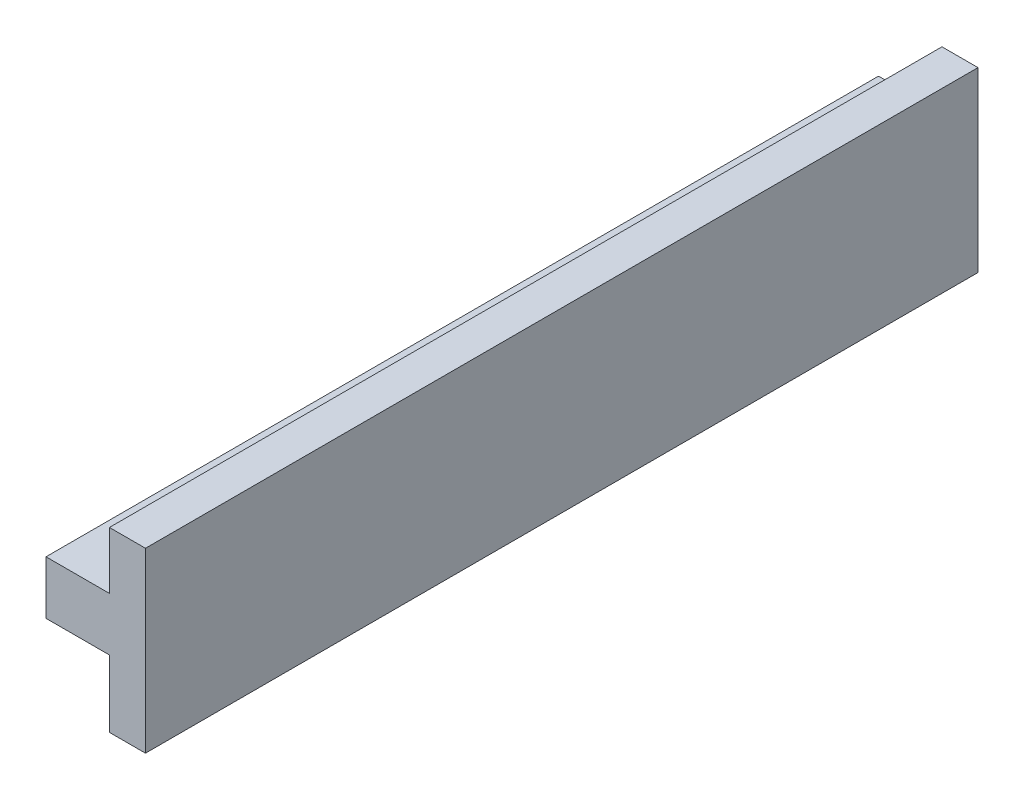
ISO-10303-21;
HEADER;
FILE_DESCRIPTION(('STEP AP214'),'2;1');
FILE_NAME('part.step','',(''),(''),'','','');
FILE_SCHEMA(('AUTOMOTIVE_DESIGN { 1 0 10303 214 1 1 1 1 }'));
ENDSEC;
DATA;
#1=APPLICATION_CONTEXT('core data for automotive mechanical design processes');
#2=APPLICATION_PROTOCOL_DEFINITION('international standard','automotive_design',2000,#1);
#3=PRODUCT_CONTEXT('',#1,'mechanical');
#4=PRODUCT('Part','Part','',(#3));
#5=PRODUCT_RELATED_PRODUCT_CATEGORY('part','',(#4));
#6=PRODUCT_DEFINITION_FORMATION('','',#4);
#7=PRODUCT_DEFINITION_CONTEXT('part definition',#1,'design');
#8=PRODUCT_DEFINITION('design','',#6,#7);
#9=PRODUCT_DEFINITION_SHAPE('','',#8);
#10=(LENGTH_UNIT() NAMED_UNIT(*) SI_UNIT(.MILLI.,.METRE.));
#11=(NAMED_UNIT(*) PLANE_ANGLE_UNIT() SI_UNIT($,.RADIAN.));
#12=(NAMED_UNIT(*) SI_UNIT($,.STERADIAN.) SOLID_ANGLE_UNIT());
#13=UNCERTAINTY_MEASURE_WITH_UNIT(LENGTH_MEASURE(1.E-05),#10,'distance_accuracy_value','');
#14=(GEOMETRIC_REPRESENTATION_CONTEXT(3) GLOBAL_UNCERTAINTY_ASSIGNED_CONTEXT((#13)) GLOBAL_UNIT_ASSIGNED_CONTEXT((#10,
#11,#12)) REPRESENTATION_CONTEXT('',''));
#15=CARTESIAN_POINT('',(0.,0.,0.));
#16=DIRECTION('',(0.,0.,1.));
#17=DIRECTION('',(1.,0.,0.));
#18=AXIS2_PLACEMENT_3D('',#15,#16,#17);
#19=CARTESIAN_POINT('',(85.9614087188153,36.3519572143948,-150.673777658695));
#20=DIRECTION('',(-1.,0.,0.));
#21=DIRECTION('',(0.,0.,1.));
#22=AXIS2_PLACEMENT_3D('',#19,#20,#21);
#23=PLANE('',#22);
#24=DIRECTION('',(0.,-1.,0.));
#25=VECTOR('',#24,1.);
#26=CARTESIAN_POINT('',(85.9614087188153,36.3519572143948,-35.1737776586952));
#27=LINE('',#26,#25);
#28=CARTESIAN_POINT('',(85.9614087188153,43.7519572143948,-35.1737776586952));
#29=VERTEX_POINT('',#28);
#30=CARTESIAN_POINT('',(85.9614087188153,36.3519572143948,-35.1737776586952));
#31=VERTEX_POINT('',#30);
#32=EDGE_CURVE('E129',#29,#31,#27,.T.);
#33=ORIENTED_EDGE('',*,*,#32,.F.);
#34=DIRECTION('',(0.,0.,1.));
#35=VECTOR('',#34,1.);
#36=CARTESIAN_POINT('',(85.9614087188153,43.7519572143948,-150.673777658695));
#37=LINE('',#36,#35);
#38=CARTESIAN_POINT('',(85.9614087188153,43.7519572143948,-150.673777658695));
#39=VERTEX_POINT('',#38);
#40=EDGE_CURVE('E11',#39,#29,#37,.T.);
#41=ORIENTED_EDGE('',*,*,#40,.F.);
#42=DIRECTION('',(0.,-1.,0.));
#43=VECTOR('',#42,1.);
#44=CARTESIAN_POINT('',(85.9614087188153,36.3519572143948,-150.673777658695));
#45=LINE('',#44,#43);
#46=CARTESIAN_POINT('',(85.9614087188153,36.3519572143948,-150.673777658695));
#47=VERTEX_POINT('',#46);
#48=EDGE_CURVE('E149',#39,#47,#45,.T.);
#49=ORIENTED_EDGE('',*,*,#48,.T.);
#50=DIRECTION('',(0.,0.,1.));
#51=VECTOR('',#50,1.);
#52=CARTESIAN_POINT('',(85.9614087188153,36.3519572143948,-150.673777658695));
#53=LINE('',#52,#51);
#54=EDGE_CURVE('E35',#47,#31,#53,.T.);
#55=ORIENTED_EDGE('',*,*,#54,.T.);
#56=EDGE_LOOP('',(#33,#41,#49,#55));
#57=FACE_BOUND('',#56,.T.);
#58=ADVANCED_FACE('F32',(#57),#23,.T.);
#59=CARTESIAN_POINT('',(85.9614087188153,43.7519572143948,-150.673777658695));
#60=DIRECTION('',(0.,1.,0.));
#61=DIRECTION('',(0.,0.,1.));
#62=AXIS2_PLACEMENT_3D('',#59,#60,#61);
#63=PLANE('',#62);
#64=DIRECTION('',(-1.,0.,0.));
#65=VECTOR('',#64,1.);
#66=CARTESIAN_POINT('',(85.9614087188153,43.7519572143948,-35.1737776586952));
#67=LINE('',#66,#65);
#68=CARTESIAN_POINT('',(94.7614087188153,43.7519572143948,-35.1737776586952));
#69=VERTEX_POINT('',#68);
#70=EDGE_CURVE('E147',#69,#29,#67,.T.);
#71=ORIENTED_EDGE('',*,*,#70,.F.);
#72=DIRECTION('',(0.,0.,1.));
#73=VECTOR('',#72,1.);
#74=CARTESIAN_POINT('',(94.7614087188153,43.7519572143948,-150.673777658695));
#75=LINE('',#74,#73);
#76=CARTESIAN_POINT('',(94.7614087188153,43.7519572143948,-150.673777658695));
#77=VERTEX_POINT('',#76);
#78=EDGE_CURVE('E41',#77,#69,#75,.T.);
#79=ORIENTED_EDGE('',*,*,#78,.F.);
#80=DIRECTION('',(-1.,0.,0.));
#81=VECTOR('',#80,1.);
#82=CARTESIAN_POINT('',(85.9614087188153,43.7519572143948,-150.673777658695));
#83=LINE('',#82,#81);
#84=EDGE_CURVE('E119',#77,#39,#83,.T.);
#85=ORIENTED_EDGE('',*,*,#84,.T.);
#86=ORIENTED_EDGE('',*,*,#40,.T.);
#87=EDGE_LOOP('',(#71,#79,#85,#86));
#88=FACE_BOUND('',#87,.T.);
#89=ADVANCED_FACE('F161',(#88),#63,.T.);
#90=CARTESIAN_POINT('',(94.7614087188153,51.6762443010053,-150.673777658695));
#91=DIRECTION('',(-1.,0.,0.));
#92=DIRECTION('',(0.,0.,1.));
#93=AXIS2_PLACEMENT_3D('',#90,#91,#92);
#94=PLANE('',#93);
#95=DIRECTION('',(0.,-1.,0.));
#96=VECTOR('',#95,1.);
#97=CARTESIAN_POINT('',(94.7614087188153,51.6762443010053,-35.1737776586952));
#98=LINE('',#97,#96);
#99=CARTESIAN_POINT('',(94.7614087188153,51.6762443010053,-35.1737776586952));
#100=VERTEX_POINT('',#99);
#101=EDGE_CURVE('E106',#100,#69,#98,.T.);
#102=ORIENTED_EDGE('',*,*,#101,.F.);
#103=DIRECTION('',(0.,0.,1.));
#104=VECTOR('',#103,1.);
#105=CARTESIAN_POINT('',(94.7614087188153,51.6762443010053,-150.673777658695));
#106=LINE('',#105,#104);
#107=CARTESIAN_POINT('',(94.7614087188153,51.6762443010053,-150.673777658695));
#108=VERTEX_POINT('',#107);
#109=EDGE_CURVE('E101',#108,#100,#106,.T.);
#110=ORIENTED_EDGE('',*,*,#109,.F.);
#111=DIRECTION('',(0.,-1.,0.));
#112=VECTOR('',#111,1.);
#113=CARTESIAN_POINT('',(94.7614087188153,51.6762443010053,-150.673777658695));
#114=LINE('',#113,#112);
#115=EDGE_CURVE('E104',#108,#77,#114,.T.);
#116=ORIENTED_EDGE('',*,*,#115,.T.);
#117=ORIENTED_EDGE('',*,*,#78,.T.);
#118=EDGE_LOOP('',(#102,#110,#116,#117));
#119=FACE_BOUND('',#118,.T.);
#120=ADVANCED_FACE('F103',(#119),#94,.T.);
#121=CARTESIAN_POINT('',(99.7614087188153,51.6762443010053,-150.673777658695));
#122=DIRECTION('',(0.,1.,0.));
#123=DIRECTION('',(0.,0.,1.));
#124=AXIS2_PLACEMENT_3D('',#121,#122,#123);
#125=PLANE('',#124);
#126=DIRECTION('',(-1.,0.,0.));
#127=VECTOR('',#126,1.);
#128=CARTESIAN_POINT('',(99.7614087188153,51.6762443010053,-35.1737776586952));
#129=LINE('',#128,#127);
#130=CARTESIAN_POINT('',(99.7614087188153,51.6762443010053,-35.1737776586952));
#131=VERTEX_POINT('',#130);
#132=EDGE_CURVE('E144',#131,#100,#129,.T.);
#133=ORIENTED_EDGE('',*,*,#132,.F.);
#134=DIRECTION('',(0.,0.,1.));
#135=VECTOR('',#134,1.);
#136=CARTESIAN_POINT('',(99.7614087188153,51.6762443010053,-150.673777658695));
#137=LINE('',#136,#135);
#138=CARTESIAN_POINT('',(99.7614087188153,51.6762443010053,-150.673777658695));
#139=VERTEX_POINT('',#138);
#140=EDGE_CURVE('E111',#139,#131,#137,.T.);
#141=ORIENTED_EDGE('',*,*,#140,.F.);
#142=DIRECTION('',(-1.,0.,0.));
#143=VECTOR('',#142,1.);
#144=CARTESIAN_POINT('',(99.7614087188153,51.6762443010053,-150.673777658695));
#145=LINE('',#144,#143);
#146=EDGE_CURVE('E117',#139,#108,#145,.T.);
#147=ORIENTED_EDGE('',*,*,#146,.T.);
#148=ORIENTED_EDGE('',*,*,#109,.T.);
#149=EDGE_LOOP('',(#133,#141,#147,#148));
#150=FACE_BOUND('',#149,.T.);
#151=ADVANCED_FACE('F121',(#150),#125,.T.);
#152=CARTESIAN_POINT('',(99.7614087188153,51.6762443010053,-150.673777658695));
#153=DIRECTION('',(1.,0.,0.));
#154=DIRECTION('',(0.,0.,-1.));
#155=AXIS2_PLACEMENT_3D('',#152,#153,#154);
#156=PLANE('',#155);
#157=DIRECTION('',(0.,1.,0.));
#158=VECTOR('',#157,1.);
#159=CARTESIAN_POINT('',(99.7614087188153,51.6762443010053,-35.1737776586952));
#160=LINE('',#159,#158);
#161=CARTESIAN_POINT('',(99.7614087188153,27.0519572143948,-35.1737776586952));
#162=VERTEX_POINT('',#161);
#163=EDGE_CURVE('E141',#162,#131,#160,.T.);
#164=ORIENTED_EDGE('',*,*,#163,.F.);
#165=DIRECTION('',(0.,0.,1.));
#166=VECTOR('',#165,1.);
#167=CARTESIAN_POINT('',(99.7614087188153,27.0519572143948,-150.673777658695));
#168=LINE('',#167,#166);
#169=CARTESIAN_POINT('',(99.7614087188153,27.0519572143948,-150.673777658695));
#170=VERTEX_POINT('',#169);
#171=EDGE_CURVE('E153',#170,#162,#168,.T.);
#172=ORIENTED_EDGE('',*,*,#171,.F.);
#173=DIRECTION('',(0.,1.,0.));
#174=VECTOR('',#173,1.);
#175=CARTESIAN_POINT('',(99.7614087188153,51.6762443010053,-150.673777658695));
#176=LINE('',#175,#174);
#177=EDGE_CURVE('E122',#170,#139,#176,.T.);
#178=ORIENTED_EDGE('',*,*,#177,.T.);
#179=ORIENTED_EDGE('',*,*,#140,.T.);
#180=EDGE_LOOP('',(#164,#172,#178,#179));
#181=FACE_BOUND('',#180,.T.);
#182=ADVANCED_FACE('F174',(#181),#156,.T.);
#183=CARTESIAN_POINT('',(99.7614087188153,27.0519572143948,-150.673777658695));
#184=DIRECTION('',(0.,-1.,0.));
#185=DIRECTION('',(0.,0.,-1.));
#186=AXIS2_PLACEMENT_3D('',#183,#184,#185);
#187=PLANE('',#186);
#188=DIRECTION('',(1.,0.,0.));
#189=VECTOR('',#188,1.);
#190=CARTESIAN_POINT('',(99.7614087188153,27.0519572143948,-35.1737776586952));
#191=LINE('',#190,#189);
#192=CARTESIAN_POINT('',(94.7614087188153,27.0519572143948,-35.1737776586952));
#193=VERTEX_POINT('',#192);
#194=EDGE_CURVE('E138',#193,#162,#191,.T.);
#195=ORIENTED_EDGE('',*,*,#194,.F.);
#196=DIRECTION('',(0.,0.,1.));
#197=VECTOR('',#196,1.);
#198=CARTESIAN_POINT('',(94.7614087188153,27.0519572143948,-150.673777658695));
#199=LINE('',#198,#197);
#200=CARTESIAN_POINT('',(94.7614087188153,27.0519572143948,-150.673777658695));
#201=VERTEX_POINT('',#200);
#202=EDGE_CURVE('E155',#201,#193,#199,.T.);
#203=ORIENTED_EDGE('',*,*,#202,.F.);
#204=DIRECTION('',(1.,0.,0.));
#205=VECTOR('',#204,1.);
#206=CARTESIAN_POINT('',(99.7614087188153,27.0519572143948,-150.673777658695));
#207=LINE('',#206,#205);
#208=EDGE_CURVE('E124',#201,#170,#207,.T.);
#209=ORIENTED_EDGE('',*,*,#208,.T.);
#210=ORIENTED_EDGE('',*,*,#171,.T.);
#211=EDGE_LOOP('',(#195,#203,#209,#210));
#212=FACE_BOUND('',#211,.T.);
#213=ADVANCED_FACE('F177',(#212),#187,.T.);
#214=CARTESIAN_POINT('',(94.7614087188153,27.0519572143948,-150.673777658695));
#215=DIRECTION('',(-1.,0.,0.));
#216=DIRECTION('',(0.,0.,1.));
#217=AXIS2_PLACEMENT_3D('',#214,#215,#216);
#218=PLANE('',#217);
#219=DIRECTION('',(0.,-1.,0.));
#220=VECTOR('',#219,1.);
#221=CARTESIAN_POINT('',(94.7614087188153,27.0519572143948,-35.1737776586952));
#222=LINE('',#221,#220);
#223=CARTESIAN_POINT('',(94.7614087188153,36.3519572143948,-35.1737776586952));
#224=VERTEX_POINT('',#223);
#225=EDGE_CURVE('E135',#224,#193,#222,.T.);
#226=ORIENTED_EDGE('',*,*,#225,.F.);
#227=DIRECTION('',(0.,0.,1.));
#228=VECTOR('',#227,1.);
#229=CARTESIAN_POINT('',(94.7614087188153,36.3519572143948,-150.673777658695));
#230=LINE('',#229,#228);
#231=CARTESIAN_POINT('',(94.7614087188153,36.3519572143948,-150.673777658695));
#232=VERTEX_POINT('',#231);
#233=EDGE_CURVE('E156',#232,#224,#230,.T.);
#234=ORIENTED_EDGE('',*,*,#233,.F.);
#235=DIRECTION('',(0.,-1.,0.));
#236=VECTOR('',#235,1.);
#237=CARTESIAN_POINT('',(94.7614087188153,27.0519572143948,-150.673777658695));
#238=LINE('',#237,#236);
#239=EDGE_CURVE('E252',#232,#201,#238,.T.);
#240=ORIENTED_EDGE('',*,*,#239,.T.);
#241=ORIENTED_EDGE('',*,*,#202,.T.);
#242=EDGE_LOOP('',(#226,#234,#240,#241));
#243=FACE_BOUND('',#242,.T.);
#244=ADVANCED_FACE('F181',(#243),#218,.T.);
#245=CARTESIAN_POINT('',(94.7614087188153,36.3519572143948,-150.673777658695));
#246=DIRECTION('',(0.,-1.,0.));
#247=DIRECTION('',(0.,0.,-1.));
#248=AXIS2_PLACEMENT_3D('',#245,#246,#247);
#249=PLANE('',#248);
#250=DIRECTION('',(1.,0.,0.));
#251=VECTOR('',#250,1.);
#252=CARTESIAN_POINT('',(94.7614087188153,36.3519572143948,-35.1737776586952));
#253=LINE('',#252,#251);
#254=EDGE_CURVE('E132',#31,#224,#253,.T.);
#255=ORIENTED_EDGE('',*,*,#254,.F.);
#256=ORIENTED_EDGE('',*,*,#54,.F.);
#257=DIRECTION('',(1.,0.,0.));
#258=VECTOR('',#257,1.);
#259=CARTESIAN_POINT('',(94.7614087188153,36.3519572143948,-150.673777658695));
#260=LINE('',#259,#258);
#261=EDGE_CURVE('E253',#47,#232,#260,.T.);
#262=ORIENTED_EDGE('',*,*,#261,.T.);
#263=ORIENTED_EDGE('',*,*,#233,.T.);
#264=EDGE_LOOP('',(#255,#256,#262,#263));
#265=FACE_BOUND('',#264,.T.);
#266=ADVANCED_FACE('F158',(#265),#249,.T.);
#267=CARTESIAN_POINT('',(0.,0.,-150.673777658695));
#268=DIRECTION('',(0.,0.,-1.));
#269=DIRECTION('',(-1.,0.,0.));
#270=AXIS2_PLACEMENT_3D('',#267,#268,#269);
#271=PLANE('',#270);
#272=ORIENTED_EDGE('',*,*,#48,.F.);
#273=ORIENTED_EDGE('',*,*,#84,.F.);
#274=ORIENTED_EDGE('',*,*,#115,.F.);
#275=ORIENTED_EDGE('',*,*,#146,.F.);
#276=ORIENTED_EDGE('',*,*,#177,.F.);
#277=ORIENTED_EDGE('',*,*,#208,.F.);
#278=ORIENTED_EDGE('',*,*,#239,.F.);
#279=ORIENTED_EDGE('',*,*,#261,.F.);
#280=EDGE_LOOP('',(#272,#273,#274,#275,#276,#277,#278,#279));
#281=FACE_BOUND('',#280,.T.);
#282=ADVANCED_FACE('F115',(#281),#271,.T.);
#283=CARTESIAN_POINT('',(0.,0.,-35.1737776586952));
#284=DIRECTION('',(0.,0.,-1.));
#285=DIRECTION('',(-1.,0.,0.));
#286=AXIS2_PLACEMENT_3D('',#283,#284,#285);
#287=PLANE('',#286);
#288=ORIENTED_EDGE('',*,*,#32,.T.);
#289=ORIENTED_EDGE('',*,*,#254,.T.);
#290=ORIENTED_EDGE('',*,*,#225,.T.);
#291=ORIENTED_EDGE('',*,*,#194,.T.);
#292=ORIENTED_EDGE('',*,*,#163,.T.);
#293=ORIENTED_EDGE('',*,*,#132,.T.);
#294=ORIENTED_EDGE('',*,*,#101,.T.);
#295=ORIENTED_EDGE('',*,*,#70,.T.);
#296=EDGE_LOOP('',(#288,#289,#290,#291,#292,#293,#294,#295));
#297=FACE_BOUND('',#296,.T.);
#298=ADVANCED_FACE('F160',(#297),#287,.F.);
#299=CLOSED_SHELL('',(#58,#89,#120,#151,#182,#213,#244,#266,#282,#298));
#300=MANIFOLD_SOLID_BREP('B2',#299);
#301=ADVANCED_BREP_SHAPE_REPRESENTATION('',(#18,#300),#14);
#302=SHAPE_DEFINITION_REPRESENTATION(#9,#301);
ENDSEC;
END-ISO-10303-21;
